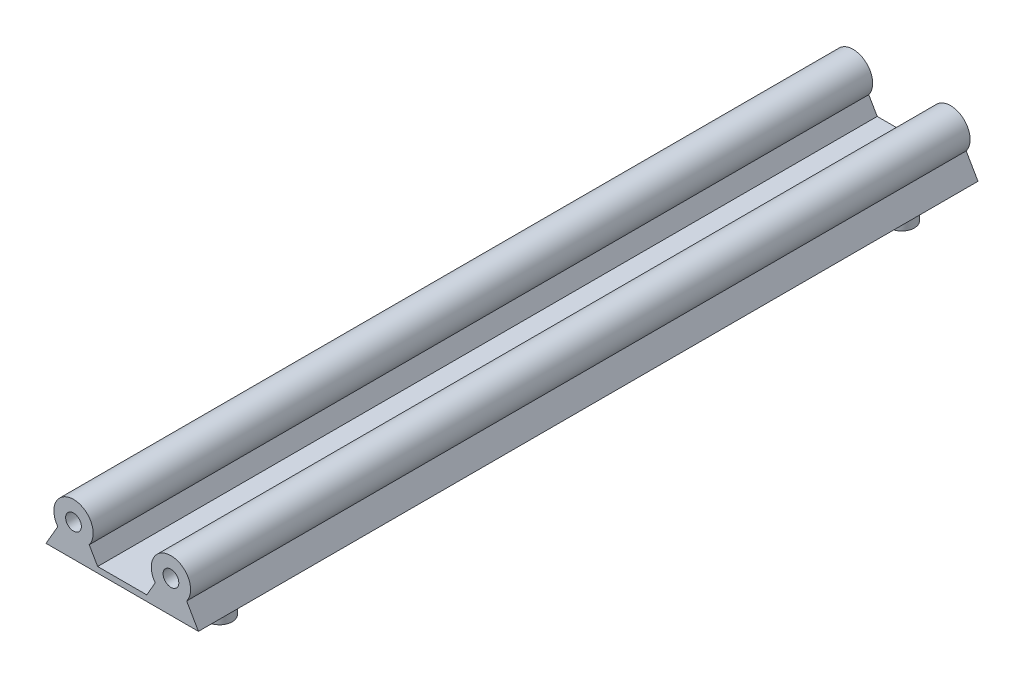
ISO-10303-21;
HEADER;
FILE_DESCRIPTION(('STEP AP214'),'2;1');
FILE_NAME('part.step','',(''),(''),'','','');
FILE_SCHEMA(('AUTOMOTIVE_DESIGN { 1 0 10303 214 1 1 1 1 }'));
ENDSEC;
DATA;
#1=APPLICATION_CONTEXT('core data for automotive mechanical design processes');
#2=APPLICATION_PROTOCOL_DEFINITION('international standard','automotive_design',2000,#1);
#3=PRODUCT_CONTEXT('',#1,'mechanical');
#4=PRODUCT('Part','Part','',(#3));
#5=PRODUCT_RELATED_PRODUCT_CATEGORY('part','',(#4));
#6=PRODUCT_DEFINITION_FORMATION('','',#4);
#7=PRODUCT_DEFINITION_CONTEXT('part definition',#1,'design');
#8=PRODUCT_DEFINITION('design','',#6,#7);
#9=PRODUCT_DEFINITION_SHAPE('','',#8);
#10=(LENGTH_UNIT() NAMED_UNIT(*) SI_UNIT(.MILLI.,.METRE.));
#11=(NAMED_UNIT(*) PLANE_ANGLE_UNIT() SI_UNIT($,.RADIAN.));
#12=(NAMED_UNIT(*) SI_UNIT($,.STERADIAN.) SOLID_ANGLE_UNIT());
#13=UNCERTAINTY_MEASURE_WITH_UNIT(LENGTH_MEASURE(1.E-05),#10,'distance_accuracy_value','');
#14=(GEOMETRIC_REPRESENTATION_CONTEXT(3) GLOBAL_UNCERTAINTY_ASSIGNED_CONTEXT((#13)) GLOBAL_UNIT_ASSIGNED_CONTEXT((#10,
#11,#12)) REPRESENTATION_CONTEXT('',''));
#15=CARTESIAN_POINT('',(0.,0.,0.));
#16=DIRECTION('',(0.,0.,1.));
#17=DIRECTION('',(1.,0.,0.));
#18=AXIS2_PLACEMENT_3D('',#15,#16,#17);
#19=CARTESIAN_POINT('',(0.,0.,220.));
#20=DIRECTION('',(0.,0.,-1.));
#21=DIRECTION('',(-1.,0.,0.));
#22=AXIS2_PLACEMENT_3D('',#19,#20,#21);
#23=CYLINDRICAL_SURFACE('',#22,5.);
#24=CARTESIAN_POINT('',(0.,0.,209.2));
#25=DIRECTION('',(0.,0.,1.));
#26=DIRECTION('',(1.,0.,0.));
#27=AXIS2_PLACEMENT_3D('',#24,#25,#26);
#28=CIRCLE('',#27,5.);
#29=CARTESIAN_POINT('',(4.,-3.,209.2));
#30=VERTEX_POINT('',#29);
#31=CARTESIAN_POINT('',(-4.,-3.,209.2));
#32=VERTEX_POINT('',#31);
#33=EDGE_CURVE('E268',#30,#32,#28,.T.);
#34=ORIENTED_EDGE('',*,*,#33,.F.);
#35=DIRECTION('',(0.,0.,-1.));
#36=VECTOR('',#35,1.);
#37=CARTESIAN_POINT('',(4.,-3.,220.));
#38=LINE('',#37,#36);
#39=CARTESIAN_POINT('',(4.,-3.,10.8));
#40=VERTEX_POINT('',#39);
#41=EDGE_CURVE('E170',#30,#40,#38,.T.);
#42=ORIENTED_EDGE('',*,*,#41,.T.);
#43=CARTESIAN_POINT('',(0.,0.,10.8));
#44=DIRECTION('',(0.,0.,-1.));
#45=DIRECTION('',(-1.,0.,0.));
#46=AXIS2_PLACEMENT_3D('',#43,#44,#45);
#47=CIRCLE('',#46,5.);
#48=CARTESIAN_POINT('',(-4.,-3.,10.8));
#49=VERTEX_POINT('',#48);
#50=EDGE_CURVE('E210',#49,#40,#47,.T.);
#51=ORIENTED_EDGE('',*,*,#50,.F.);
#52=DIRECTION('',(0.,0.,-1.));
#53=VECTOR('',#52,1.);
#54=CARTESIAN_POINT('',(-4.,-3.,220.));
#55=LINE('',#54,#53);
#56=EDGE_CURVE('E176',#32,#49,#55,.T.);
#57=ORIENTED_EDGE('',*,*,#56,.F.);
#58=EDGE_LOOP('',(#34,#42,#51,#57));
#59=FACE_BOUND('',#58,.T.);
#60=ADVANCED_FACE('F49',(#59),#23,.T.);
#61=CARTESIAN_POINT('',(-1.70096189432334,0.982050807568877,220.));
#62=DIRECTION('',(0.866025403784438,-0.5,0.));
#63=DIRECTION('',(0.5,0.866025403784439,0.));
#64=AXIS2_PLACEMENT_3D('',#61,#62,#63);
#65=PLANE('',#64);
#66=DIRECTION('',(-0.5,-0.866025403784439,0.));
#67=VECTOR('',#66,1.);
#68=CARTESIAN_POINT('',(-4.,-3.,209.2));
#69=LINE('',#68,#67);
#70=CARTESIAN_POINT('',(-7.,-8.19615242270663,209.2));
#71=VERTEX_POINT('',#70);
#72=EDGE_CURVE('E198',#32,#71,#69,.T.);
#73=ORIENTED_EDGE('',*,*,#72,.F.);
#74=ORIENTED_EDGE('',*,*,#56,.T.);
#75=DIRECTION('',(0.5,0.866025403784439,0.));
#76=VECTOR('',#75,1.);
#77=CARTESIAN_POINT('',(-7.,-8.19615242270663,10.8));
#78=LINE('',#77,#76);
#79=CARTESIAN_POINT('',(-7.,-8.19615242270663,10.8));
#80=VERTEX_POINT('',#79);
#81=EDGE_CURVE('E205',#80,#49,#78,.T.);
#82=ORIENTED_EDGE('',*,*,#81,.F.);
#83=DIRECTION('',(0.,0.,-1.));
#84=VECTOR('',#83,1.);
#85=CARTESIAN_POINT('',(-7.,-8.19615242270663,220.));
#86=LINE('',#85,#84);
#87=EDGE_CURVE('E173',#71,#80,#86,.T.);
#88=ORIENTED_EDGE('',*,*,#87,.F.);
#89=EDGE_LOOP('',(#73,#74,#82,#88));
#90=FACE_BOUND('',#89,.T.);
#91=ADVANCED_FACE('F188',(#90),#65,.F.);
#92=CARTESIAN_POINT('',(0.,-8.19615242270663,220.));
#93=DIRECTION('',(0.,1.,0.));
#94=DIRECTION('',(0.,0.,1.));
#95=AXIS2_PLACEMENT_3D('',#92,#93,#94);
#96=PLANE('',#95);
#97=CARTESIAN_POINT('',(24.8000000000018,-8.19615242270663,23.2000000000003));
#98=DIRECTION('',(0.,1.,0.));
#99=DIRECTION('',(0.,0.,1.));
#100=AXIS2_PLACEMENT_3D('',#97,#98,#99);
#101=CIRCLE('',#100,3.2);
#102=CARTESIAN_POINT('',(24.8000000000018,-8.19615242270663,26.4000000000003));
#103=VERTEX_POINT('',#102);
#104=EDGE_CURVE('E152',#103,#103,#101,.F.);
#105=ORIENTED_EDGE('',*,*,#104,.F.);
#106=EDGE_LOOP('',(#105));
#107=FACE_BOUND('',#106,.T.);
#108=CARTESIAN_POINT('',(24.8,-8.19615242270663,196.8));
#109=DIRECTION('',(0.,1.,0.));
#110=DIRECTION('',(0.,0.,1.));
#111=AXIS2_PLACEMENT_3D('',#108,#109,#110);
#112=CIRCLE('',#111,3.2);
#113=CARTESIAN_POINT('',(24.8,-8.19615242270663,200.));
#114=VERTEX_POINT('',#113);
#115=EDGE_CURVE('E148',#114,#114,#112,.F.);
#116=ORIENTED_EDGE('',*,*,#115,.F.);
#117=EDGE_LOOP('',(#116));
#118=FACE_BOUND('',#117,.T.);
#119=CARTESIAN_POINT('',(0.,-8.19615242270663,196.8));
#120=DIRECTION('',(0.,1.,0.));
#121=DIRECTION('',(0.,0.,1.));
#122=AXIS2_PLACEMENT_3D('',#119,#120,#121);
#123=CIRCLE('',#122,3.20000000000001);
#124=CARTESIAN_POINT('',(0.,-8.19615242270663,200.));
#125=VERTEX_POINT('',#124);
#126=EDGE_CURVE('E57',#125,#125,#123,.F.);
#127=ORIENTED_EDGE('',*,*,#126,.F.);
#128=EDGE_LOOP('',(#127));
#129=FACE_BOUND('',#128,.T.);
#130=CARTESIAN_POINT('',(1.8077335470529E-12,-8.19615242270663,23.2));
#131=DIRECTION('',(0.,1.,0.));
#132=DIRECTION('',(0.,0.,1.));
#133=AXIS2_PLACEMENT_3D('',#130,#131,#132);
#134=CIRCLE('',#133,3.2);
#135=CARTESIAN_POINT('',(1.8077335470529E-12,-8.19615242270663,26.4));
#136=VERTEX_POINT('',#135);
#137=EDGE_CURVE('E11',#136,#136,#134,.F.);
#138=ORIENTED_EDGE('',*,*,#137,.F.);
#139=EDGE_LOOP('',(#138));
#140=FACE_BOUND('',#139,.T.);
#141=DIRECTION('',(1.,0.,0.));
#142=VECTOR('',#141,1.);
#143=CARTESIAN_POINT('',(-7.,-8.19615242270663,209.2));
#144=LINE('',#143,#142);
#145=CARTESIAN_POINT('',(31.8,-8.19615242270663,209.2));
#146=VERTEX_POINT('',#145);
#147=EDGE_CURVE('E64',#71,#146,#144,.T.);
#148=ORIENTED_EDGE('',*,*,#147,.F.);
#149=ORIENTED_EDGE('',*,*,#87,.T.);
#150=DIRECTION('',(-1.,0.,0.));
#151=VECTOR('',#150,1.);
#152=CARTESIAN_POINT('',(31.8,-8.19615242270663,10.8));
#153=LINE('',#152,#151);
#154=CARTESIAN_POINT('',(31.8,-8.19615242270663,10.8));
#155=VERTEX_POINT('',#154);
#156=EDGE_CURVE('E211',#155,#80,#153,.T.);
#157=ORIENTED_EDGE('',*,*,#156,.F.);
#158=DIRECTION('',(0.,0.,-1.));
#159=VECTOR('',#158,1.);
#160=CARTESIAN_POINT('',(31.8,-8.19615242270663,220.));
#161=LINE('',#160,#159);
#162=EDGE_CURVE('E137',#146,#155,#161,.T.);
#163=ORIENTED_EDGE('',*,*,#162,.F.);
#164=EDGE_LOOP('',(#148,#149,#157,#163));
#165=FACE_BOUND('',#164,.T.);
#166=ADVANCED_FACE('F184',(#107,#118,#129,#140,#165),#96,.F.);
#167=CARTESIAN_POINT('',(1.70096189432334,0.982050807568877,220.));
#168=DIRECTION('',(0.866025403784438,0.5,0.));
#169=DIRECTION('',(-0.5,0.866025403784439,0.));
#170=AXIS2_PLACEMENT_3D('',#167,#168,#169);
#171=PLANE('',#170);
#172=ORIENTED_EDGE('',*,*,#41,.F.);
#173=DIRECTION('',(-0.5,0.866025403784439,0.));
#174=VECTOR('',#173,1.);
#175=CARTESIAN_POINT('',(6.15,-6.72390923627308,209.2));
#176=LINE('',#175,#174);
#177=CARTESIAN_POINT('',(6.15,-6.72390923627308,209.2));
#178=VERTEX_POINT('',#177);
#179=EDGE_CURVE('E271',#178,#30,#176,.T.);
#180=ORIENTED_EDGE('',*,*,#179,.F.);
#181=DIRECTION('',(0.,0.,1.));
#182=VECTOR('',#181,1.);
#183=CARTESIAN_POINT('',(6.15,-6.72390923627308,0.));
#184=LINE('',#183,#182);
#185=CARTESIAN_POINT('',(6.15,-6.72390923627308,10.8));
#186=VERTEX_POINT('',#185);
#187=EDGE_CURVE('E156',#186,#178,#184,.T.);
#188=ORIENTED_EDGE('',*,*,#187,.F.);
#189=DIRECTION('',(0.5,-0.866025403784439,0.));
#190=VECTOR('',#189,1.);
#191=CARTESIAN_POINT('',(4.,-3.,10.8));
#192=LINE('',#191,#190);
#193=EDGE_CURVE('E215',#40,#186,#192,.T.);
#194=ORIENTED_EDGE('',*,*,#193,.F.);
#195=EDGE_LOOP('',(#172,#180,#188,#194));
#196=FACE_BOUND('',#195,.T.);
#197=ADVANCED_FACE('F187',(#196),#171,.T.);
#198=CARTESIAN_POINT('',(6.15,-6.72390923627308,0.));
#199=DIRECTION('',(0.,1.,0.));
#200=DIRECTION('',(-1.,0.,0.));
#201=AXIS2_PLACEMENT_3D('',#198,#199,#200);
#202=PLANE('',#201);
#203=ORIENTED_EDGE('',*,*,#187,.T.);
#204=DIRECTION('',(-1.,0.,0.));
#205=VECTOR('',#204,1.);
#206=CARTESIAN_POINT('',(18.65,-6.72390923627309,209.2));
#207=LINE('',#206,#205);
#208=CARTESIAN_POINT('',(18.65,-6.72390923627309,209.2));
#209=VERTEX_POINT('',#208);
#210=EDGE_CURVE('E132',#209,#178,#207,.T.);
#211=ORIENTED_EDGE('',*,*,#210,.F.);
#212=DIRECTION('',(0.,0.,1.));
#213=VECTOR('',#212,1.);
#214=CARTESIAN_POINT('',(18.65,-6.72390923627309,0.));
#215=LINE('',#214,#213);
#216=CARTESIAN_POINT('',(18.65,-6.72390923627309,10.8));
#217=VERTEX_POINT('',#216);
#218=EDGE_CURVE('E130',#217,#209,#215,.T.);
#219=ORIENTED_EDGE('',*,*,#218,.F.);
#220=DIRECTION('',(1.,0.,0.));
#221=VECTOR('',#220,1.);
#222=CARTESIAN_POINT('',(6.15,-6.72390923627308,10.8));
#223=LINE('',#222,#221);
#224=EDGE_CURVE('E223',#186,#217,#223,.T.);
#225=ORIENTED_EDGE('',*,*,#224,.F.);
#226=EDGE_LOOP('',(#203,#211,#219,#225));
#227=FACE_BOUND('',#226,.T.);
#228=ADVANCED_FACE('F280',(#227),#202,.T.);
#229=CARTESIAN_POINT('',(24.8,0.,220.));
#230=DIRECTION('',(0.,0.,-1.));
#231=DIRECTION('',(-1.,0.,0.));
#232=AXIS2_PLACEMENT_3D('',#229,#230,#231);
#233=CYLINDRICAL_SURFACE('',#232,5.);
#234=DIRECTION('',(0.,0.,-1.));
#235=VECTOR('',#234,1.);
#236=CARTESIAN_POINT('',(20.8,-3.,220.));
#237=LINE('',#236,#235);
#238=CARTESIAN_POINT('',(20.8,-3.,209.2));
#239=VERTEX_POINT('',#238);
#240=CARTESIAN_POINT('',(20.8,-3.,10.8));
#241=VERTEX_POINT('',#240);
#242=EDGE_CURVE('E127',#239,#241,#237,.T.);
#243=ORIENTED_EDGE('',*,*,#242,.F.);
#244=CARTESIAN_POINT('',(24.8,0.,209.2));
#245=DIRECTION('',(0.,0.,1.));
#246=DIRECTION('',(1.,0.,0.));
#247=AXIS2_PLACEMENT_3D('',#244,#245,#246);
#248=CIRCLE('',#247,5.);
#249=CARTESIAN_POINT('',(28.8,-3.,209.2));
#250=VERTEX_POINT('',#249);
#251=EDGE_CURVE('E113',#250,#239,#248,.T.);
#252=ORIENTED_EDGE('',*,*,#251,.F.);
#253=DIRECTION('',(0.,0.,-1.));
#254=VECTOR('',#253,1.);
#255=CARTESIAN_POINT('',(28.8,-3.,220.));
#256=LINE('',#255,#254);
#257=CARTESIAN_POINT('',(28.8,-3.,10.8));
#258=VERTEX_POINT('',#257);
#259=EDGE_CURVE('E72',#250,#258,#256,.T.);
#260=ORIENTED_EDGE('',*,*,#259,.T.);
#261=CARTESIAN_POINT('',(24.8,0.,10.8));
#262=DIRECTION('',(0.,0.,-1.));
#263=DIRECTION('',(-1.,0.,0.));
#264=AXIS2_PLACEMENT_3D('',#261,#262,#263);
#265=CIRCLE('',#264,5.);
#266=EDGE_CURVE('E135',#241,#258,#265,.T.);
#267=ORIENTED_EDGE('',*,*,#266,.F.);
#268=EDGE_LOOP('',(#243,#252,#260,#267));
#269=FACE_BOUND('',#268,.T.);
#270=ADVANCED_FACE('F134',(#269),#233,.T.);
#271=CARTESIAN_POINT('',(20.8,-3.,220.));
#272=DIRECTION('',(0.866025403784439,-0.5,0.));
#273=DIRECTION('',(0.5,0.866025403784439,0.));
#274=AXIS2_PLACEMENT_3D('',#271,#272,#273);
#275=PLANE('',#274);
#276=DIRECTION('',(-0.5,-0.866025403784439,0.));
#277=VECTOR('',#276,1.);
#278=CARTESIAN_POINT('',(20.8,-3.,209.2));
#279=LINE('',#278,#277);
#280=EDGE_CURVE('E116',#239,#209,#279,.T.);
#281=ORIENTED_EDGE('',*,*,#280,.F.);
#282=ORIENTED_EDGE('',*,*,#242,.T.);
#283=DIRECTION('',(0.5,0.866025403784439,0.));
#284=VECTOR('',#283,1.);
#285=CARTESIAN_POINT('',(18.65,-6.72390923627309,10.8));
#286=LINE('',#285,#284);
#287=EDGE_CURVE('E226',#217,#241,#286,.T.);
#288=ORIENTED_EDGE('',*,*,#287,.F.);
#289=ORIENTED_EDGE('',*,*,#218,.T.);
#290=EDGE_LOOP('',(#281,#282,#288,#289));
#291=FACE_BOUND('',#290,.T.);
#292=ADVANCED_FACE('F125',(#291),#275,.F.);
#293=CARTESIAN_POINT('',(28.8,-3.,220.));
#294=DIRECTION('',(0.866025403784438,0.5,0.));
#295=DIRECTION('',(-0.5,0.866025403784438,0.));
#296=AXIS2_PLACEMENT_3D('',#293,#294,#295);
#297=PLANE('',#296);
#298=ORIENTED_EDGE('',*,*,#259,.F.);
#299=DIRECTION('',(-0.5,0.866025403784438,0.));
#300=VECTOR('',#299,1.);
#301=CARTESIAN_POINT('',(31.8,-8.19615242270663,209.2));
#302=LINE('',#301,#300);
#303=EDGE_CURVE('E118',#146,#250,#302,.T.);
#304=ORIENTED_EDGE('',*,*,#303,.F.);
#305=ORIENTED_EDGE('',*,*,#162,.T.);
#306=DIRECTION('',(0.5,-0.866025403784438,0.));
#307=VECTOR('',#306,1.);
#308=CARTESIAN_POINT('',(28.8,-3.,10.8));
#309=LINE('',#308,#307);
#310=EDGE_CURVE('E217',#258,#155,#309,.T.);
#311=ORIENTED_EDGE('',*,*,#310,.F.);
#312=EDGE_LOOP('',(#298,#304,#305,#311));
#313=FACE_BOUND('',#312,.T.);
#314=ADVANCED_FACE('F295',(#313),#297,.T.);
#315=CARTESIAN_POINT('',(0.,-14.1961524227066,196.8));
#316=DIRECTION('',(0.,1.,0.));
#317=DIRECTION('',(0.,0.,1.));
#318=AXIS2_PLACEMENT_3D('',#315,#316,#317);
#319=CYLINDRICAL_SURFACE('',#318,3.20000000000001);
#320=CARTESIAN_POINT('',(0.,-14.1961524227066,196.8));
#321=DIRECTION('',(0.,-1.,0.));
#322=DIRECTION('',(0.,0.,-1.));
#323=AXIS2_PLACEMENT_3D('',#320,#321,#322);
#324=CIRCLE('',#323,3.20000000000001);
#325=CARTESIAN_POINT('',(0.,-14.1961524227066,193.6));
#326=VERTEX_POINT('',#325);
#327=EDGE_CURVE('E166',#326,#326,#324,.T.);
#328=ORIENTED_EDGE('',*,*,#327,.F.);
#329=EDGE_LOOP('',(#328));
#330=FACE_BOUND('',#329,.T.);
#331=ORIENTED_EDGE('',*,*,#126,.T.);
#332=EDGE_LOOP('',(#331));
#333=FACE_BOUND('',#332,.T.);
#334=ADVANCED_FACE('F182',(#330,#333),#319,.T.);
#335=CARTESIAN_POINT('',(0.,-14.1961524227066,196.8));
#336=DIRECTION('',(0.,-1.,0.));
#337=DIRECTION('',(0.,0.,-1.));
#338=AXIS2_PLACEMENT_3D('',#335,#336,#337);
#339=PLANE('',#338);
#340=ORIENTED_EDGE('',*,*,#327,.T.);
#341=EDGE_LOOP('',(#340));
#342=FACE_BOUND('',#341,.T.);
#343=ADVANCED_FACE('F303',(#342),#339,.T.);
#344=CARTESIAN_POINT('',(1.8077335470529E-12,-14.1961524227066,23.2));
#345=DIRECTION('',(0.,1.,0.));
#346=DIRECTION('',(0.,0.,1.));
#347=AXIS2_PLACEMENT_3D('',#344,#345,#346);
#348=CYLINDRICAL_SURFACE('',#347,3.2);
#349=CARTESIAN_POINT('',(1.8077335470529E-12,-14.1961524227066,23.2));
#350=DIRECTION('',(0.,-1.,0.));
#351=DIRECTION('',(0.,0.,-1.));
#352=AXIS2_PLACEMENT_3D('',#349,#350,#351);
#353=CIRCLE('',#352,3.2);
#354=CARTESIAN_POINT('',(1.8077335470529E-12,-14.1961524227066,20.));
#355=VERTEX_POINT('',#354);
#356=EDGE_CURVE('E160',#355,#355,#353,.T.);
#357=ORIENTED_EDGE('',*,*,#356,.F.);
#358=EDGE_LOOP('',(#357));
#359=FACE_BOUND('',#358,.T.);
#360=ORIENTED_EDGE('',*,*,#137,.T.);
#361=EDGE_LOOP('',(#360));
#362=FACE_BOUND('',#361,.T.);
#363=ADVANCED_FACE('F256',(#359,#362),#348,.T.);
#364=CARTESIAN_POINT('',(1.8077335470529E-12,-14.1961524227066,23.2));
#365=DIRECTION('',(0.,-1.,0.));
#366=DIRECTION('',(0.,0.,-1.));
#367=AXIS2_PLACEMENT_3D('',#364,#365,#366);
#368=PLANE('',#367);
#369=ORIENTED_EDGE('',*,*,#356,.T.);
#370=EDGE_LOOP('',(#369));
#371=FACE_BOUND('',#370,.T.);
#372=ADVANCED_FACE('F247',(#371),#368,.T.);
#373=CARTESIAN_POINT('',(24.8,-14.1961524227066,196.8));
#374=DIRECTION('',(0.,1.,0.));
#375=DIRECTION('',(0.,0.,1.));
#376=AXIS2_PLACEMENT_3D('',#373,#374,#375);
#377=CYLINDRICAL_SURFACE('',#376,3.2);
#378=CARTESIAN_POINT('',(24.8,-14.1961524227066,196.8));
#379=DIRECTION('',(0.,-1.,0.));
#380=DIRECTION('',(0.,0.,-1.));
#381=AXIS2_PLACEMENT_3D('',#378,#379,#380);
#382=CIRCLE('',#381,3.2);
#383=CARTESIAN_POINT('',(24.8,-14.1961524227066,193.6));
#384=VERTEX_POINT('',#383);
#385=EDGE_CURVE('E138',#384,#384,#382,.T.);
#386=ORIENTED_EDGE('',*,*,#385,.F.);
#387=EDGE_LOOP('',(#386));
#388=FACE_BOUND('',#387,.T.);
#389=ORIENTED_EDGE('',*,*,#115,.T.);
#390=EDGE_LOOP('',(#389));
#391=FACE_BOUND('',#390,.T.);
#392=ADVANCED_FACE('F245',(#388,#391),#377,.T.);
#393=CARTESIAN_POINT('',(24.8,-14.1961524227066,196.8));
#394=DIRECTION('',(0.,-1.,0.));
#395=DIRECTION('',(0.,0.,-1.));
#396=AXIS2_PLACEMENT_3D('',#393,#394,#395);
#397=PLANE('',#396);
#398=ORIENTED_EDGE('',*,*,#385,.T.);
#399=EDGE_LOOP('',(#398));
#400=FACE_BOUND('',#399,.T.);
#401=ADVANCED_FACE('F239',(#400),#397,.T.);
#402=CARTESIAN_POINT('',(24.8000000000018,-14.1961524227066,23.2000000000003));
#403=DIRECTION('',(0.,1.,0.));
#404=DIRECTION('',(0.,0.,1.));
#405=AXIS2_PLACEMENT_3D('',#402,#403,#404);
#406=CYLINDRICAL_SURFACE('',#405,3.2);
#407=CARTESIAN_POINT('',(24.8000000000018,-14.1961524227066,23.2000000000003));
#408=DIRECTION('',(0.,-1.,0.));
#409=DIRECTION('',(0.,0.,-1.));
#410=AXIS2_PLACEMENT_3D('',#407,#408,#409);
#411=CIRCLE('',#410,3.2);
#412=CARTESIAN_POINT('',(24.8000000000018,-14.1961524227066,20.0000000000003));
#413=VERTEX_POINT('',#412);
#414=EDGE_CURVE('E144',#413,#413,#411,.T.);
#415=ORIENTED_EDGE('',*,*,#414,.F.);
#416=EDGE_LOOP('',(#415));
#417=FACE_BOUND('',#416,.T.);
#418=ORIENTED_EDGE('',*,*,#104,.T.);
#419=EDGE_LOOP('',(#418));
#420=FACE_BOUND('',#419,.T.);
#421=ADVANCED_FACE('F236',(#417,#420),#406,.T.);
#422=CARTESIAN_POINT('',(24.8000000000018,-14.1961524227066,23.2000000000003));
#423=DIRECTION('',(0.,-1.,0.));
#424=DIRECTION('',(0.,0.,-1.));
#425=AXIS2_PLACEMENT_3D('',#422,#423,#424);
#426=PLANE('',#425);
#427=ORIENTED_EDGE('',*,*,#414,.T.);
#428=EDGE_LOOP('',(#427));
#429=FACE_BOUND('',#428,.T.);
#430=ADVANCED_FACE('F234',(#429),#426,.T.);
#431=CARTESIAN_POINT('',(24.8,0.,10.8));
#432=DIRECTION('',(0.,0.,-1.));
#433=DIRECTION('',(-1.,0.,0.));
#434=AXIS2_PLACEMENT_3D('',#431,#432,#433);
#435=PLANE('',#434);
#436=CARTESIAN_POINT('',(0.,0.,10.8));
#437=DIRECTION('',(0.,0.,-1.));
#438=DIRECTION('',(-1.,0.,0.));
#439=AXIS2_PLACEMENT_3D('',#436,#437,#438);
#440=CIRCLE('',#439,2.);
#441=CARTESIAN_POINT('',(-2.,0.,10.8));
#442=VERTEX_POINT('',#441);
#443=EDGE_CURVE('E441',#442,#442,#440,.T.);
#444=ORIENTED_EDGE('',*,*,#443,.F.);
#445=EDGE_LOOP('',(#444));
#446=FACE_BOUND('',#445,.T.);
#447=CARTESIAN_POINT('',(24.8,-1.73177474406619E-13,10.8));
#448=DIRECTION('',(0.,0.,-1.));
#449=DIRECTION('',(-1.,0.,0.));
#450=AXIS2_PLACEMENT_3D('',#447,#448,#449);
#451=CIRCLE('',#450,2.);
#452=CARTESIAN_POINT('',(22.8,-1.73177474406619E-13,10.8));
#453=VERTEX_POINT('',#452);
#454=EDGE_CURVE('E449',#453,#453,#451,.T.);
#455=ORIENTED_EDGE('',*,*,#454,.F.);
#456=EDGE_LOOP('',(#455));
#457=FACE_BOUND('',#456,.T.);
#458=ORIENTED_EDGE('',*,*,#266,.T.);
#459=ORIENTED_EDGE('',*,*,#310,.T.);
#460=ORIENTED_EDGE('',*,*,#156,.T.);
#461=ORIENTED_EDGE('',*,*,#81,.T.);
#462=ORIENTED_EDGE('',*,*,#50,.T.);
#463=ORIENTED_EDGE('',*,*,#193,.T.);
#464=ORIENTED_EDGE('',*,*,#224,.T.);
#465=ORIENTED_EDGE('',*,*,#287,.T.);
#466=EDGE_LOOP('',(#458,#459,#460,#461,#462,#463,#464,#465));
#467=FACE_BOUND('',#466,.T.);
#468=ADVANCED_FACE('F278',(#446,#457,#467),#435,.T.);
#469=CARTESIAN_POINT('',(24.8,0.,209.2));
#470=DIRECTION('',(0.,0.,1.));
#471=DIRECTION('',(1.,0.,0.));
#472=AXIS2_PLACEMENT_3D('',#469,#470,#471);
#473=PLANE('',#472);
#474=CARTESIAN_POINT('',(0.,0.,209.2));
#475=DIRECTION('',(0.,0.,1.));
#476=DIRECTION('',(1.,0.,0.));
#477=AXIS2_PLACEMENT_3D('',#474,#475,#476);
#478=CIRCLE('',#477,2.);
#479=CARTESIAN_POINT('',(2.,0.,209.2));
#480=VERTEX_POINT('',#479);
#481=EDGE_CURVE('E462',#480,#480,#478,.T.);
#482=ORIENTED_EDGE('',*,*,#481,.F.);
#483=EDGE_LOOP('',(#482));
#484=FACE_BOUND('',#483,.T.);
#485=CARTESIAN_POINT('',(24.8,0.,209.2));
#486=DIRECTION('',(0.,0.,1.));
#487=DIRECTION('',(1.,0.,0.));
#488=AXIS2_PLACEMENT_3D('',#485,#486,#487);
#489=CIRCLE('',#488,2.);
#490=CARTESIAN_POINT('',(26.8,0.,209.2));
#491=VERTEX_POINT('',#490);
#492=EDGE_CURVE('E446',#491,#491,#489,.T.);
#493=ORIENTED_EDGE('',*,*,#492,.F.);
#494=EDGE_LOOP('',(#493));
#495=FACE_BOUND('',#494,.T.);
#496=ORIENTED_EDGE('',*,*,#251,.T.);
#497=ORIENTED_EDGE('',*,*,#280,.T.);
#498=ORIENTED_EDGE('',*,*,#210,.T.);
#499=ORIENTED_EDGE('',*,*,#179,.T.);
#500=ORIENTED_EDGE('',*,*,#33,.T.);
#501=ORIENTED_EDGE('',*,*,#72,.T.);
#502=ORIENTED_EDGE('',*,*,#147,.T.);
#503=ORIENTED_EDGE('',*,*,#303,.T.);
#504=EDGE_LOOP('',(#496,#497,#498,#499,#500,#501,#502,#503));
#505=FACE_BOUND('',#504,.T.);
#506=ADVANCED_FACE('F115',(#484,#495,#505),#473,.T.);
#507=CARTESIAN_POINT('',(24.8,0.,202.2));
#508=DIRECTION('',(0.,0.,1.));
#509=DIRECTION('',(1.,0.,0.));
#510=AXIS2_PLACEMENT_3D('',#507,#508,#509);
#511=CYLINDRICAL_SURFACE('',#510,2.);
#512=CARTESIAN_POINT('',(24.8,0.,202.2));
#513=DIRECTION('',(0.,0.,1.));
#514=DIRECTION('',(1.,0.,0.));
#515=AXIS2_PLACEMENT_3D('',#512,#513,#514);
#516=CIRCLE('',#515,2.);
#517=CARTESIAN_POINT('',(26.8,0.,202.2));
#518=VERTEX_POINT('',#517);
#519=EDGE_CURVE('E440',#518,#518,#516,.T.);
#520=ORIENTED_EDGE('',*,*,#519,.F.);
#521=EDGE_LOOP('',(#520));
#522=FACE_BOUND('',#521,.T.);
#523=ORIENTED_EDGE('',*,*,#492,.T.);
#524=EDGE_LOOP('',(#523));
#525=FACE_BOUND('',#524,.T.);
#526=ADVANCED_FACE('F402',(#522,#525),#511,.F.);
#527=CARTESIAN_POINT('',(24.8,0.,202.2));
#528=DIRECTION('',(0.,0.,1.));
#529=DIRECTION('',(1.,0.,0.));
#530=AXIS2_PLACEMENT_3D('',#527,#528,#529);
#531=PLANE('',#530);
#532=ORIENTED_EDGE('',*,*,#519,.T.);
#533=EDGE_LOOP('',(#532));
#534=FACE_BOUND('',#533,.T.);
#535=ADVANCED_FACE('F404',(#534),#531,.T.);
#536=CARTESIAN_POINT('',(0.,0.,202.2));
#537=DIRECTION('',(0.,0.,1.));
#538=DIRECTION('',(1.,0.,0.));
#539=AXIS2_PLACEMENT_3D('',#536,#537,#538);
#540=CYLINDRICAL_SURFACE('',#539,2.);
#541=CARTESIAN_POINT('',(0.,0.,202.2));
#542=DIRECTION('',(0.,0.,1.));
#543=DIRECTION('',(1.,0.,0.));
#544=AXIS2_PLACEMENT_3D('',#541,#542,#543);
#545=CIRCLE('',#544,2.);
#546=CARTESIAN_POINT('',(2.,0.,202.2));
#547=VERTEX_POINT('',#546);
#548=EDGE_CURVE('E121',#547,#547,#545,.T.);
#549=ORIENTED_EDGE('',*,*,#548,.F.);
#550=EDGE_LOOP('',(#549));
#551=FACE_BOUND('',#550,.T.);
#552=ORIENTED_EDGE('',*,*,#481,.T.);
#553=EDGE_LOOP('',(#552));
#554=FACE_BOUND('',#553,.T.);
#555=ADVANCED_FACE('F407',(#551,#554),#540,.F.);
#556=CARTESIAN_POINT('',(0.,0.,202.2));
#557=DIRECTION('',(0.,0.,1.));
#558=DIRECTION('',(1.,0.,0.));
#559=AXIS2_PLACEMENT_3D('',#556,#557,#558);
#560=PLANE('',#559);
#561=ORIENTED_EDGE('',*,*,#548,.T.);
#562=EDGE_LOOP('',(#561));
#563=FACE_BOUND('',#562,.T.);
#564=ADVANCED_FACE('F414',(#563),#560,.T.);
#565=CARTESIAN_POINT('',(24.8,-1.73177474406619E-13,17.8));
#566=DIRECTION('',(0.,0.,-1.));
#567=DIRECTION('',(-1.,0.,0.));
#568=AXIS2_PLACEMENT_3D('',#565,#566,#567);
#569=CYLINDRICAL_SURFACE('',#568,2.);
#570=CARTESIAN_POINT('',(24.8,-1.73177474406619E-13,17.8));
#571=DIRECTION('',(0.,0.,-1.));
#572=DIRECTION('',(-1.,0.,0.));
#573=AXIS2_PLACEMENT_3D('',#570,#571,#572);
#574=CIRCLE('',#573,2.);
#575=CARTESIAN_POINT('',(22.8,-1.73177474406619E-13,17.8));
#576=VERTEX_POINT('',#575);
#577=EDGE_CURVE('E455',#576,#576,#574,.T.);
#578=ORIENTED_EDGE('',*,*,#577,.F.);
#579=EDGE_LOOP('',(#578));
#580=FACE_BOUND('',#579,.T.);
#581=ORIENTED_EDGE('',*,*,#454,.T.);
#582=EDGE_LOOP('',(#581));
#583=FACE_BOUND('',#582,.T.);
#584=ADVANCED_FACE('F418',(#580,#583),#569,.F.);
#585=CARTESIAN_POINT('',(24.8,-1.73177474406619E-13,17.8));
#586=DIRECTION('',(0.,0.,-1.));
#587=DIRECTION('',(-1.,0.,0.));
#588=AXIS2_PLACEMENT_3D('',#585,#586,#587);
#589=PLANE('',#588);
#590=ORIENTED_EDGE('',*,*,#577,.T.);
#591=EDGE_LOOP('',(#590));
#592=FACE_BOUND('',#591,.T.);
#593=ADVANCED_FACE('F420',(#592),#589,.T.);
#594=CARTESIAN_POINT('',(0.,0.,17.8));
#595=DIRECTION('',(0.,0.,-1.));
#596=DIRECTION('',(-1.,0.,0.));
#597=AXIS2_PLACEMENT_3D('',#594,#595,#596);
#598=CYLINDRICAL_SURFACE('',#597,2.);
#599=CARTESIAN_POINT('',(0.,0.,17.8));
#600=DIRECTION('',(0.,0.,-1.));
#601=DIRECTION('',(-1.,0.,0.));
#602=AXIS2_PLACEMENT_3D('',#599,#600,#601);
#603=CIRCLE('',#602,2.);
#604=CARTESIAN_POINT('',(-2.,0.,17.8));
#605=VERTEX_POINT('',#604);
#606=EDGE_CURVE('E438',#605,#605,#603,.T.);
#607=ORIENTED_EDGE('',*,*,#606,.F.);
#608=EDGE_LOOP('',(#607));
#609=FACE_BOUND('',#608,.T.);
#610=ORIENTED_EDGE('',*,*,#443,.T.);
#611=EDGE_LOOP('',(#610));
#612=FACE_BOUND('',#611,.T.);
#613=ADVANCED_FACE('F423',(#609,#612),#598,.F.);
#614=CARTESIAN_POINT('',(0.,0.,17.8));
#615=DIRECTION('',(0.,0.,-1.));
#616=DIRECTION('',(-1.,0.,0.));
#617=AXIS2_PLACEMENT_3D('',#614,#615,#616);
#618=PLANE('',#617);
#619=ORIENTED_EDGE('',*,*,#606,.T.);
#620=EDGE_LOOP('',(#619));
#621=FACE_BOUND('',#620,.T.);
#622=ADVANCED_FACE('F430',(#621),#618,.T.);
#623=CLOSED_SHELL('',(#60,#91,#166,#197,#228,#270,#292,#314,#334,#343,#363,#372,#392,#401,#421,
#430,#468,#506,#526,#535,#555,#564,#584,#593,#613,#622));
#624=MANIFOLD_SOLID_BREP('B2',#623);
#625=ADVANCED_BREP_SHAPE_REPRESENTATION('',(#18,#624),#14);
#626=SHAPE_DEFINITION_REPRESENTATION(#9,#625);
ENDSEC;
END-ISO-10303-21;
